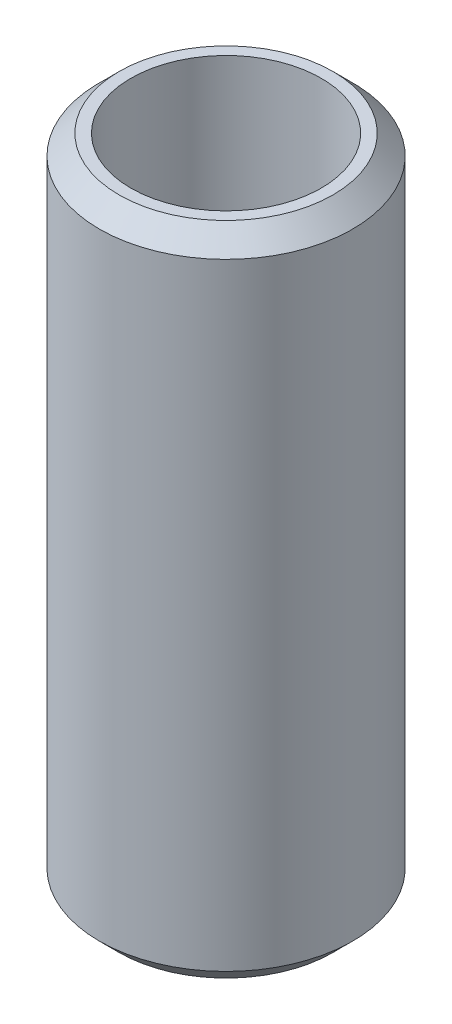
ISO-10303-21;
HEADER;
FILE_DESCRIPTION(('STEP AP214'),'2;1');
FILE_NAME('part.step','',(''),(''),'','','');
FILE_SCHEMA(('AUTOMOTIVE_DESIGN { 1 0 10303 214 1 1 1 1 }'));
ENDSEC;
DATA;
#1=APPLICATION_CONTEXT('core data for automotive mechanical design processes');
#2=APPLICATION_PROTOCOL_DEFINITION('international standard','automotive_design',2000,#1);
#3=PRODUCT_CONTEXT('',#1,'mechanical');
#4=PRODUCT('Part','Part','',(#3));
#5=PRODUCT_RELATED_PRODUCT_CATEGORY('part','',(#4));
#6=PRODUCT_DEFINITION_FORMATION('','',#4);
#7=PRODUCT_DEFINITION_CONTEXT('part definition',#1,'design');
#8=PRODUCT_DEFINITION('design','',#6,#7);
#9=PRODUCT_DEFINITION_SHAPE('','',#8);
#10=(LENGTH_UNIT() NAMED_UNIT(*) SI_UNIT(.MILLI.,.METRE.));
#11=(NAMED_UNIT(*) PLANE_ANGLE_UNIT() SI_UNIT($,.RADIAN.));
#12=(NAMED_UNIT(*) SI_UNIT($,.STERADIAN.) SOLID_ANGLE_UNIT());
#13=UNCERTAINTY_MEASURE_WITH_UNIT(LENGTH_MEASURE(1.E-05),#10,'distance_accuracy_value','');
#14=(GEOMETRIC_REPRESENTATION_CONTEXT(3) GLOBAL_UNCERTAINTY_ASSIGNED_CONTEXT((#13)) GLOBAL_UNIT_ASSIGNED_CONTEXT((#10,
#11,#12)) REPRESENTATION_CONTEXT('',''));
#15=CARTESIAN_POINT('',(0.,0.,0.));
#16=DIRECTION('',(0.,0.,1.));
#17=DIRECTION('',(1.,0.,0.));
#18=AXIS2_PLACEMENT_3D('',#15,#16,#17);
#19=CARTESIAN_POINT('',(0.,194.250427746743,0.));
#20=DIRECTION('',(0.,-1.,0.));
#21=DIRECTION('',(0.,0.,-1.));
#22=AXIS2_PLACEMENT_3D('',#19,#20,#21);
#23=CYLINDRICAL_SURFACE('',#22,37.5);
#24=CARTESIAN_POINT('',(0.,188.410625303964,0.));
#25=DIRECTION('',(0.,1.,0.));
#26=DIRECTION('',(0.,0.,1.));
#27=AXIS2_PLACEMENT_3D('',#24,#25,#26);
#28=CIRCLE('',#27,37.5);
#29=CARTESIAN_POINT('',(0.,188.410625303964,37.5));
#30=VERTEX_POINT('',#29);
#31=EDGE_CURVE('E50',#30,#30,#28,.F.);
#32=ORIENTED_EDGE('',*,*,#31,.T.);
#33=EDGE_LOOP('',(#32));
#34=FACE_BOUND('',#33,.T.);
#35=CARTESIAN_POINT('',(0.,5.83980244277979,0.));
#36=DIRECTION('',(0.,1.,0.));
#37=DIRECTION('',(0.,0.,1.));
#38=AXIS2_PLACEMENT_3D('',#35,#36,#37);
#39=CIRCLE('',#38,37.5);
#40=CARTESIAN_POINT('',(0.,5.83980244277979,37.5));
#41=VERTEX_POINT('',#40);
#42=EDGE_CURVE('E51',#41,#41,#39,.T.);
#43=ORIENTED_EDGE('',*,*,#42,.T.);
#44=EDGE_LOOP('',(#43));
#45=FACE_BOUND('',#44,.T.);
#46=ADVANCED_FACE('F39',(#34,#45),#23,.T.);
#47=CARTESIAN_POINT('',(0.,194.250427746743,0.));
#48=DIRECTION('',(0.,1.,0.));
#49=DIRECTION('',(0.,0.,1.));
#50=AXIS2_PLACEMENT_3D('',#47,#48,#49);
#51=PLANE('',#50);
#52=CARTESIAN_POINT('',(0.,194.250427746743,0.));
#53=DIRECTION('',(0.,1.,0.));
#54=DIRECTION('',(0.,0.,1.));
#55=AXIS2_PLACEMENT_3D('',#52,#53,#54);
#56=CIRCLE('',#55,31.6601975572201);
#57=CARTESIAN_POINT('',(0.,194.250427746743,31.6601975572201));
#58=VERTEX_POINT('',#57);
#59=EDGE_CURVE('E54',#58,#58,#56,.T.);
#60=ORIENTED_EDGE('',*,*,#59,.T.);
#61=EDGE_LOOP('',(#60));
#62=FACE_BOUND('',#61,.T.);
#63=CARTESIAN_POINT('',(0.,194.250427746743,0.));
#64=DIRECTION('',(0.,1.,0.));
#65=DIRECTION('',(0.,0.,1.));
#66=AXIS2_PLACEMENT_3D('',#63,#64,#65);
#67=CIRCLE('',#66,28.1871292095287);
#68=CARTESIAN_POINT('',(0.,194.250427746743,28.1871292095287));
#69=VERTEX_POINT('',#68);
#70=EDGE_CURVE('E58',#69,#69,#67,.T.);
#71=ORIENTED_EDGE('',*,*,#70,.F.);
#72=EDGE_LOOP('',(#71));
#73=FACE_BOUND('',#72,.T.);
#74=ADVANCED_FACE('F69',(#62,#73),#51,.T.);
#75=CARTESIAN_POINT('',(0.,0.,0.));
#76=DIRECTION('',(0.,1.,0.));
#77=DIRECTION('',(0.,0.,1.));
#78=AXIS2_PLACEMENT_3D('',#75,#76,#77);
#79=PLANE('',#78);
#80=CARTESIAN_POINT('',(0.,0.,0.));
#81=DIRECTION('',(0.,1.,0.));
#82=DIRECTION('',(0.,0.,1.));
#83=AXIS2_PLACEMENT_3D('',#80,#81,#82);
#84=CIRCLE('',#83,31.6601975572202);
#85=CARTESIAN_POINT('',(0.,0.,31.6601975572202));
#86=VERTEX_POINT('',#85);
#87=EDGE_CURVE('E10',#86,#86,#84,.F.);
#88=ORIENTED_EDGE('',*,*,#87,.T.);
#89=EDGE_LOOP('',(#88));
#90=FACE_BOUND('',#89,.T.);
#91=CARTESIAN_POINT('',(0.,0.,0.));
#92=DIRECTION('',(0.,1.,0.));
#93=DIRECTION('',(0.,0.,1.));
#94=AXIS2_PLACEMENT_3D('',#91,#92,#93);
#95=CIRCLE('',#94,28.1871292095287);
#96=CARTESIAN_POINT('',(0.,0.,28.1871292095287));
#97=VERTEX_POINT('',#96);
#98=EDGE_CURVE('E63',#97,#97,#95,.T.);
#99=ORIENTED_EDGE('',*,*,#98,.T.);
#100=EDGE_LOOP('',(#99));
#101=FACE_BOUND('',#100,.T.);
#102=ADVANCED_FACE('F75',(#90,#101),#79,.F.);
#103=CARTESIAN_POINT('',(0.,194.250427746743,0.));
#104=DIRECTION('',(0.,-1.,0.));
#105=DIRECTION('',(0.,0.,-1.));
#106=AXIS2_PLACEMENT_3D('',#103,#104,#105);
#107=CYLINDRICAL_SURFACE('',#106,28.1871292095287);
#108=ORIENTED_EDGE('',*,*,#70,.T.);
#109=EDGE_LOOP('',(#108));
#110=FACE_BOUND('',#109,.T.);
#111=ORIENTED_EDGE('',*,*,#98,.F.);
#112=EDGE_LOOP('',(#111));
#113=FACE_BOUND('',#112,.T.);
#114=ADVANCED_FACE('F70',(#110,#113),#107,.F.);
#115=CARTESIAN_POINT('',(0.,194.250427746743,0.));
#116=DIRECTION('',(0.,-1.,0.));
#117=DIRECTION('',(0.,0.,-1.));
#118=AXIS2_PLACEMENT_3D('',#115,#116,#117);
#119=CONICAL_SURFACE('',#118,31.6601975572201,0.785398163397446);
#120=ORIENTED_EDGE('',*,*,#31,.F.);
#121=EDGE_LOOP('',(#120));
#122=FACE_BOUND('',#121,.T.);
#123=ORIENTED_EDGE('',*,*,#59,.F.);
#124=EDGE_LOOP('',(#123));
#125=FACE_BOUND('',#124,.T.);
#126=ADVANCED_FACE('F81',(#122,#125),#119,.T.);
#127=CARTESIAN_POINT('',(0.,5.83980244277979,0.));
#128=DIRECTION('',(0.,1.,0.));
#129=DIRECTION('',(0.,0.,1.));
#130=AXIS2_PLACEMENT_3D('',#127,#128,#129);
#131=CONICAL_SURFACE('',#130,37.5,0.785398163397453);
#132=CARTESIAN_POINT('',(0.,0.,31.6601975572202));
#133=CARTESIAN_POINT('',(0.,0.0608312754456228,31.7210288326658));
#134=CARTESIAN_POINT('',(0.,0.121662550891245,31.7818601081114));
#135=CARTESIAN_POINT('',(0.,0.243325101782491,31.9035226590026));
#136=CARTESIAN_POINT('',(0.,0.304156377228113,31.9643539344483));
#137=CARTESIAN_POINT('',(0.,0.425818928119359,32.0860164853395));
#138=CARTESIAN_POINT('',(0.,0.486650203564981,32.1468477607851));
#139=CARTESIAN_POINT('',(0.,0.608312754456227,32.2685103116764));
#140=CARTESIAN_POINT('',(0.,0.66914402990185,32.329341587122));
#141=CARTESIAN_POINT('',(0.,0.790806580793097,32.4510041380133));
#142=CARTESIAN_POINT('',(0.,0.851637856238719,32.5118354134589));
#143=CARTESIAN_POINT('',(0.,0.973300407129964,32.6334979643501));
#144=CARTESIAN_POINT('',(0.,1.03413168257559,32.6943292397958));
#145=CARTESIAN_POINT('',(0.,1.15579423346683,32.815991790687));
#146=CARTESIAN_POINT('',(0.,1.21662550891246,32.8768230661326));
#147=CARTESIAN_POINT('',(0.,1.3382880598037,32.9984856170239));
#148=CARTESIAN_POINT('',(0.,1.39911933524932,33.0593168924695));
#149=CARTESIAN_POINT('',(0.,1.52078188614057,33.1809794433607));
#150=CARTESIAN_POINT('',(0.,1.58161316158619,33.2418107188064));
#151=CARTESIAN_POINT('',(0.,1.70327571247744,33.3634732696976));
#152=CARTESIAN_POINT('',(0.,1.76410698792306,33.4243045451432));
#153=CARTESIAN_POINT('',(0.,1.88576953881431,33.5459670960345));
#154=CARTESIAN_POINT('',(0.,1.94660081425993,33.6067983714801));
#155=CARTESIAN_POINT('',(0.,2.06826336515117,33.7284609223714));
#156=CARTESIAN_POINT('',(0.,2.1290946405968,33.789292197817));
#157=CARTESIAN_POINT('',(0.,2.25075719148804,33.9109547487082));
#158=CARTESIAN_POINT('',(0.,2.31158846693367,33.9717860241539));
#159=CARTESIAN_POINT('',(0.,2.43325101782491,34.0934485750451));
#160=CARTESIAN_POINT('',(0.,2.49408229327053,34.1542798504907));
#161=CARTESIAN_POINT('',(0.,2.61574484416178,34.275942401382));
#162=CARTESIAN_POINT('',(0.,2.6765761196074,34.3367736768276));
#163=CARTESIAN_POINT('',(0.,2.79823867049865,34.4584362277188));
#164=CARTESIAN_POINT('',(0.,2.85906994594427,34.5192675031645));
#165=CARTESIAN_POINT('',(0.,2.98073249683552,34.6409300540557));
#166=CARTESIAN_POINT('',(0.,3.04156377228114,34.7017613295013));
#167=CARTESIAN_POINT('',(0.,3.16322632317239,34.8234238803926));
#168=CARTESIAN_POINT('',(0.,3.22405759861801,34.8842551558382));
#169=CARTESIAN_POINT('',(0.,3.34572014950925,35.0059177067294));
#170=CARTESIAN_POINT('',(0.,3.40655142495488,35.0667489821751));
#171=CARTESIAN_POINT('',(0.,3.52821397584612,35.1884115330663));
#172=CARTESIAN_POINT('',(0.,3.58904525129175,35.2492428085119));
#173=CARTESIAN_POINT('',(0.,3.71070780218299,35.3709053594032));
#174=CARTESIAN_POINT('',(0.,3.77153907762861,35.4317366348488));
#175=CARTESIAN_POINT('',(0.,3.89320162851986,35.5533991857401));
#176=CARTESIAN_POINT('',(0.,3.95403290396548,35.6142304611857));
#177=CARTESIAN_POINT('',(0.,4.07569545485673,35.7358930120769));
#178=CARTESIAN_POINT('',(0.,4.13652673030235,35.7967242875226));
#179=CARTESIAN_POINT('',(0.,4.2581892811936,35.9183868384138));
#180=CARTESIAN_POINT('',(0.,4.31902055663922,35.9792181138594));
#181=CARTESIAN_POINT('',(0.,4.44068310753046,36.1008806647507));
#182=CARTESIAN_POINT('',(0.,4.50151438297609,36.1617119401963));
#183=CARTESIAN_POINT('',(0.,4.62317693386733,36.2833744910875));
#184=CARTESIAN_POINT('',(0.,4.68400820931296,36.3442057665332));
#185=CARTESIAN_POINT('',(0.,4.8056707602042,36.4658683174244));
#186=CARTESIAN_POINT('',(0.,4.86650203564982,36.52669959287));
#187=CARTESIAN_POINT('',(0.,4.98816458654107,36.6483621437613));
#188=CARTESIAN_POINT('',(0.,5.04899586198669,36.7091934192069));
#189=CARTESIAN_POINT('',(0.,5.17065841287794,36.8308559700981));
#190=CARTESIAN_POINT('',(0.,5.23148968832356,36.8916872455438));
#191=CARTESIAN_POINT('',(0.,5.35315223921481,37.013349796435));
#192=CARTESIAN_POINT('',(0.,5.41398351466043,37.0741810718806));
#193=CARTESIAN_POINT('',(0.,5.53564606555167,37.1958436227719));
#194=CARTESIAN_POINT('',(0.,5.5964773409973,37.2566748982175));
#195=CARTESIAN_POINT('',(0.,5.71813989188854,37.3783374491088));
#196=CARTESIAN_POINT('',(0.,5.77897116733417,37.4391687245544));
#197=CARTESIAN_POINT('',(0.,5.83980244277979,37.5));
#198=B_SPLINE_CURVE_WITH_KNOTS('',3,(#132,#133,#134,#135,#136,#137,#138,#139,#140,#141,#142,
#143,#144,#145,#146,#147,#148,#149,#150,#151,#152,#153,#154,#155,#156,#157,#158,#159,#160,#161,
#162,#163,#164,#165,#166,#167,#168,#169,#170,#171,#172,#173,#174,#175,#176,#177,#178,#179,#180,
#181,#182,#183,#184,#185,#186,#187,#188,#189,#190,#191,#192,#193,#194,#195,#196,#197),
.UNSPECIFIED.,.F.,.F.,(4,2,2,2,2,2,2,2,2,2,2,2,2,2,2,2,2,2,2,2,2,2,2,2,2,2,2,2,2,2,2,2,4),(0.,
0.258085244254958,0.516170488509921,0.774255732764883,1.03234097701984,1.2904262212748,
1.54851146552977,1.80659670978472,2.06468195403969,2.32276719829464,2.58085244254961,
2.83893768680457,3.09702293105953,3.35510817531449,3.61319341956945,3.87127866382441,
4.12936390807937,4.38744915233433,4.6455343965893,4.90361964084426,5.16170488509922,
5.41979012935418,5.67787537360914,5.9359606178641,6.19404586211906,6.45213110637402,
6.71021635062898,6.96830159488395,7.2263868391389,7.48447208339387,7.74255732764883,
8.00064257190379,8.25872781615875),.UNSPECIFIED.);
#199=EDGE_CURVE('BSEAM45',#86,#41,#198,.T.);
#200=ORIENTED_EDGE('',*,*,#87,.F.);
#201=ORIENTED_EDGE('',*,*,#42,.F.);
#202=ORIENTED_EDGE('',*,*,#199,.T.);
#203=ORIENTED_EDGE('',*,*,#199,.F.);
#204=EDGE_LOOP('',(#200,#202,#201,#203));
#205=FACE_BOUND('',#204,.T.);
#206=ADVANCED_FACE('F45',(#205),#131,.T.);
#207=CLOSED_SHELL('',(#46,#74,#102,#114,#126,#206));
#208=MANIFOLD_SOLID_BREP('B2',#207);
#209=ADVANCED_BREP_SHAPE_REPRESENTATION('',(#18,#208),#14);
#210=SHAPE_DEFINITION_REPRESENTATION(#9,#209);
ENDSEC;
END-ISO-10303-21;
